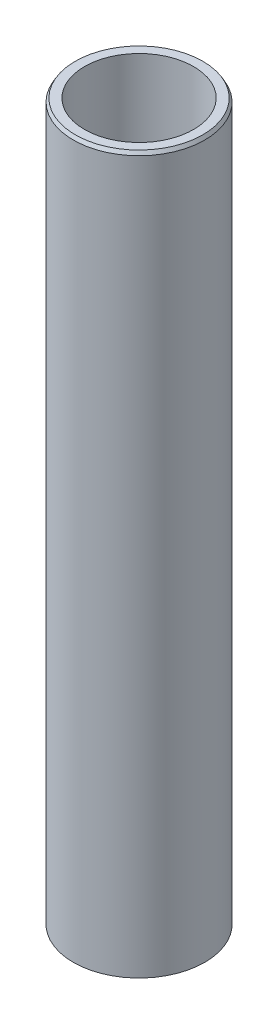
ISO-10303-21;
HEADER;
FILE_DESCRIPTION(('STEP AP214'),'2;1');
FILE_NAME('part.step','',(''),(''),'','','');
FILE_SCHEMA(('AUTOMOTIVE_DESIGN { 1 0 10303 214 1 1 1 1 }'));
ENDSEC;
DATA;
#1=APPLICATION_CONTEXT('core data for automotive mechanical design processes');
#2=APPLICATION_PROTOCOL_DEFINITION('international standard','automotive_design',2000,#1);
#3=PRODUCT_CONTEXT('',#1,'mechanical');
#4=PRODUCT('Part','Part','',(#3));
#5=PRODUCT_RELATED_PRODUCT_CATEGORY('part','',(#4));
#6=PRODUCT_DEFINITION_FORMATION('','',#4);
#7=PRODUCT_DEFINITION_CONTEXT('part definition',#1,'design');
#8=PRODUCT_DEFINITION('design','',#6,#7);
#9=PRODUCT_DEFINITION_SHAPE('','',#8);
#10=(LENGTH_UNIT() NAMED_UNIT(*) SI_UNIT(.MILLI.,.METRE.));
#11=(NAMED_UNIT(*) PLANE_ANGLE_UNIT() SI_UNIT($,.RADIAN.));
#12=(NAMED_UNIT(*) SI_UNIT($,.STERADIAN.) SOLID_ANGLE_UNIT());
#13=UNCERTAINTY_MEASURE_WITH_UNIT(LENGTH_MEASURE(1.E-05),#10,'distance_accuracy_value','');
#14=(GEOMETRIC_REPRESENTATION_CONTEXT(3) GLOBAL_UNCERTAINTY_ASSIGNED_CONTEXT((#13)) GLOBAL_UNIT_ASSIGNED_CONTEXT((#10,
#11,#12)) REPRESENTATION_CONTEXT('',''));
#15=CARTESIAN_POINT('',(0.,0.,0.));
#16=DIRECTION('',(0.,0.,1.));
#17=DIRECTION('',(1.,0.,0.));
#18=AXIS2_PLACEMENT_3D('',#15,#16,#17);
#19=CARTESIAN_POINT('',(0.,600.,0.));
#20=DIRECTION('',(0.,-1.,0.));
#21=DIRECTION('',(0.,0.,-1.));
#22=AXIS2_PLACEMENT_3D('',#19,#20,#21);
#23=CYLINDRICAL_SURFACE('',#22,55.);
#24=CARTESIAN_POINT('',(0.,597.078124167466,0.));
#25=DIRECTION('',(0.,1.,0.));
#26=DIRECTION('',(0.,0.,1.));
#27=AXIS2_PLACEMENT_3D('',#24,#25,#26);
#28=CIRCLE('',#27,55.);
#29=CARTESIAN_POINT('',(0.,597.078124167465,-55.));
#30=VERTEX_POINT('',#29);
#31=EDGE_CURVE('E50',#30,#30,#28,.F.);
#32=ORIENTED_EDGE('',*,*,#31,.T.);
#33=EDGE_LOOP('',(#32));
#34=FACE_BOUND('',#33,.T.);
#35=CARTESIAN_POINT('',(0.,1.6869457984523,0.));
#36=DIRECTION('',(0.,1.,0.));
#37=DIRECTION('',(0.,0.,1.));
#38=AXIS2_PLACEMENT_3D('',#35,#36,#37);
#39=CIRCLE('',#38,55.);
#40=CARTESIAN_POINT('',(0.,1.6869457984523,55.));
#41=VERTEX_POINT('',#40);
#42=EDGE_CURVE('E51',#41,#41,#39,.T.);
#43=ORIENTED_EDGE('',*,*,#42,.T.);
#44=EDGE_LOOP('',(#43));
#45=FACE_BOUND('',#44,.T.);
#46=ADVANCED_FACE('F39',(#34,#45),#23,.T.);
#47=CARTESIAN_POINT('',(0.,600.,0.));
#48=DIRECTION('',(0.,1.,0.));
#49=DIRECTION('',(0.,0.,1.));
#50=AXIS2_PLACEMENT_3D('',#47,#48,#49);
#51=PLANE('',#50);
#52=CARTESIAN_POINT('',(0.,600.,0.));
#53=DIRECTION('',(0.,1.,0.));
#54=DIRECTION('',(0.,0.,1.));
#55=AXIS2_PLACEMENT_3D('',#52,#53,#54);
#56=CIRCLE('',#55,53.3130542015477);
#57=CARTESIAN_POINT('',(0.,600.,-53.3130542015477));
#58=VERTEX_POINT('',#57);
#59=EDGE_CURVE('E54',#58,#58,#56,.T.);
#60=ORIENTED_EDGE('',*,*,#59,.T.);
#61=EDGE_LOOP('',(#60));
#62=FACE_BOUND('',#61,.T.);
#63=CARTESIAN_POINT('',(0.,600.,0.));
#64=DIRECTION('',(0.,1.,0.));
#65=DIRECTION('',(0.,0.,1.));
#66=AXIS2_PLACEMENT_3D('',#63,#64,#65);
#67=CIRCLE('',#66,45.6130111693613);
#68=CARTESIAN_POINT('',(0.,600.,45.6130111693613));
#69=VERTEX_POINT('',#68);
#70=EDGE_CURVE('E58',#69,#69,#67,.T.);
#71=ORIENTED_EDGE('',*,*,#70,.F.);
#72=EDGE_LOOP('',(#71));
#73=FACE_BOUND('',#72,.T.);
#74=ADVANCED_FACE('F69',(#62,#73),#51,.T.);
#75=CARTESIAN_POINT('',(0.,0.,0.));
#76=DIRECTION('',(0.,1.,0.));
#77=DIRECTION('',(0.,0.,1.));
#78=AXIS2_PLACEMENT_3D('',#75,#76,#77);
#79=PLANE('',#78);
#80=CARTESIAN_POINT('',(0.,0.,0.));
#81=DIRECTION('',(0.,1.,0.));
#82=DIRECTION('',(0.,0.,1.));
#83=AXIS2_PLACEMENT_3D('',#80,#81,#82);
#84=CIRCLE('',#83,52.0781241674658);
#85=CARTESIAN_POINT('',(0.,0.,52.0781241674658));
#86=VERTEX_POINT('',#85);
#87=EDGE_CURVE('E10',#86,#86,#84,.F.);
#88=ORIENTED_EDGE('',*,*,#87,.T.);
#89=EDGE_LOOP('',(#88));
#90=FACE_BOUND('',#89,.T.);
#91=CARTESIAN_POINT('',(0.,0.,0.));
#92=DIRECTION('',(0.,1.,0.));
#93=DIRECTION('',(0.,0.,1.));
#94=AXIS2_PLACEMENT_3D('',#91,#92,#93);
#95=CIRCLE('',#94,45.6130111693613);
#96=CARTESIAN_POINT('',(0.,0.,45.6130111693613));
#97=VERTEX_POINT('',#96);
#98=EDGE_CURVE('E63',#97,#97,#95,.T.);
#99=ORIENTED_EDGE('',*,*,#98,.T.);
#100=EDGE_LOOP('',(#99));
#101=FACE_BOUND('',#100,.T.);
#102=ADVANCED_FACE('F75',(#90,#101),#79,.F.);
#103=CARTESIAN_POINT('',(0.,600.,0.));
#104=DIRECTION('',(0.,-1.,0.));
#105=DIRECTION('',(0.,0.,-1.));
#106=AXIS2_PLACEMENT_3D('',#103,#104,#105);
#107=CYLINDRICAL_SURFACE('',#106,45.6130111693613);
#108=ORIENTED_EDGE('',*,*,#70,.T.);
#109=EDGE_LOOP('',(#108));
#110=FACE_BOUND('',#109,.T.);
#111=ORIENTED_EDGE('',*,*,#98,.F.);
#112=EDGE_LOOP('',(#111));
#113=FACE_BOUND('',#112,.T.);
#114=ADVANCED_FACE('F70',(#110,#113),#107,.F.);
#115=CARTESIAN_POINT('',(0.,600.,0.));
#116=DIRECTION('',(0.,-1.,0.));
#117=DIRECTION('',(0.,0.,-1.));
#118=AXIS2_PLACEMENT_3D('',#115,#116,#117);
#119=CONICAL_SURFACE('',#118,53.3130542015477,0.523598775598285);
#120=CARTESIAN_POINT('',(0.,597.078124167465,-55.));
#121=CARTESIAN_POINT('',(0.,597.108560374054,-54.9824276479328));
#122=CARTESIAN_POINT('',(0.,597.138996580643,-54.9648552958656));
#123=CARTESIAN_POINT('',(0.,597.199868993821,-54.9297105917312));
#124=CARTESIAN_POINT('',(0.,597.23030520041,-54.912138239664));
#125=CARTESIAN_POINT('',(0.,597.291177613588,-54.8769935355296));
#126=CARTESIAN_POINT('',(0.,597.321613820177,-54.8594211834623));
#127=CARTESIAN_POINT('',(0.,597.382486233355,-54.8242764793279));
#128=CARTESIAN_POINT('',(0.,597.412922439943,-54.8067041272607));
#129=CARTESIAN_POINT('',(0.,597.473794853121,-54.7715594231263));
#130=CARTESIAN_POINT('',(0.,597.50423105971,-54.7539870710591));
#131=CARTESIAN_POINT('',(0.,597.565103472888,-54.7188423669247));
#132=CARTESIAN_POINT('',(0.,597.595539679477,-54.7012700148574));
#133=CARTESIAN_POINT('',(0.,597.656412092655,-54.666125310723));
#134=CARTESIAN_POINT('',(0.,597.686848299244,-54.6485529586558));
#135=CARTESIAN_POINT('',(0.,597.747720712421,-54.6134082545214));
#136=CARTESIAN_POINT('',(0.,597.77815691901,-54.5958359024542));
#137=CARTESIAN_POINT('',(0.,597.839029332188,-54.5606911983197));
#138=CARTESIAN_POINT('',(0.,597.869465538777,-54.5431188462525));
#139=CARTESIAN_POINT('',(0.,597.930337951955,-54.5079741421181));
#140=CARTESIAN_POINT('',(0.,597.960774158544,-54.4904017900509));
#141=CARTESIAN_POINT('',(0.,598.021646571721,-54.4552570859165));
#142=CARTESIAN_POINT('',(0.,598.05208277831,-54.4376847338493));
#143=CARTESIAN_POINT('',(0.,598.112955191488,-54.4025400297148));
#144=CARTESIAN_POINT('',(0.,598.143391398077,-54.3849676776476));
#145=CARTESIAN_POINT('',(0.,598.204263811255,-54.3498229735132));
#146=CARTESIAN_POINT('',(0.,598.234700017844,-54.332250621446));
#147=CARTESIAN_POINT('',(0.,598.295572431022,-54.2971059173116));
#148=CARTESIAN_POINT('',(0.,598.32600863761,-54.2795335652444));
#149=CARTESIAN_POINT('',(0.,598.386881050788,-54.2443888611099));
#150=CARTESIAN_POINT('',(0.,598.417317257377,-54.2268165090427));
#151=CARTESIAN_POINT('',(0.,598.478189670555,-54.1916718049083));
#152=CARTESIAN_POINT('',(0.,598.508625877144,-54.1740994528411));
#153=CARTESIAN_POINT('',(0.,598.569498290322,-54.1389547487067));
#154=CARTESIAN_POINT('',(0.,598.59993449691,-54.1213823966395));
#155=CARTESIAN_POINT('',(0.,598.660806910088,-54.086237692505));
#156=CARTESIAN_POINT('',(0.,598.691243116677,-54.0686653404378));
#157=CARTESIAN_POINT('',(0.,598.752115529855,-54.0335206363034));
#158=CARTESIAN_POINT('',(0.,598.782551736444,-54.0159482842362));
#159=CARTESIAN_POINT('',(0.,598.843424149622,-53.9808035801018));
#160=CARTESIAN_POINT('',(0.,598.873860356211,-53.9632312280346));
#161=CARTESIAN_POINT('',(0.,598.934732769388,-53.9280865239001));
#162=CARTESIAN_POINT('',(0.,598.965168975977,-53.9105141718329));
#163=CARTESIAN_POINT('',(0.,599.026041389155,-53.8753694676985));
#164=CARTESIAN_POINT('',(0.,599.056477595744,-53.8577971156313));
#165=CARTESIAN_POINT('',(0.,599.117350008922,-53.8226524114969));
#166=CARTESIAN_POINT('',(0.,599.147786215511,-53.8050800594296));
#167=CARTESIAN_POINT('',(0.,599.208658628689,-53.7699353552952));
#168=CARTESIAN_POINT('',(0.,599.239094835277,-53.752363003228));
#169=CARTESIAN_POINT('',(0.,599.299967248455,-53.7172182990936));
#170=CARTESIAN_POINT('',(0.,599.330403455044,-53.6996459470264));
#171=CARTESIAN_POINT('',(0.,599.391275868222,-53.664501242892));
#172=CARTESIAN_POINT('',(0.,599.421712074811,-53.6469288908247));
#173=CARTESIAN_POINT('',(0.,599.482584487989,-53.6117841866903));
#174=CARTESIAN_POINT('',(0.,599.513020694577,-53.5942118346231));
#175=CARTESIAN_POINT('',(0.,599.573893107755,-53.5590671304887));
#176=CARTESIAN_POINT('',(0.,599.604329314344,-53.5414947784215));
#177=CARTESIAN_POINT('',(0.,599.665201727522,-53.5063500742871));
#178=CARTESIAN_POINT('',(0.,599.695637934111,-53.4887777222198));
#179=CARTESIAN_POINT('',(0.,599.756510347289,-53.4536330180854));
#180=CARTESIAN_POINT('',(0.,599.786946553878,-53.4360606660182));
#181=CARTESIAN_POINT('',(0.,599.847818967055,-53.4009159618838));
#182=CARTESIAN_POINT('',(0.,599.878255173644,-53.3833436098166));
#183=CARTESIAN_POINT('',(0.,599.939127586822,-53.3481989056821));
#184=CARTESIAN_POINT('',(0.,599.969563793411,-53.3306265536149));
#185=CARTESIAN_POINT('',(0.,600.,-53.3130542015477));
#186=B_SPLINE_CURVE_WITH_KNOTS('',3,(#120,#121,#122,#123,#124,#125,#126,#127,#128,#129,#130,
#131,#132,#133,#134,#135,#136,#137,#138,#139,#140,#141,#142,#143,#144,#145,#146,#147,#148,#149,
#150,#151,#152,#153,#154,#155,#156,#157,#158,#159,#160,#161,#162,#163,#164,#165,#166,#167,#168,
#169,#170,#171,#172,#173,#174,#175,#176,#177,#178,#179,#180,#181,#182,#183,#184,#185),
.UNSPECIFIED.,.F.,.F.,(4,2,2,2,2,2,2,2,2,2,2,2,2,2,2,2,2,2,2,2,2,2,2,2,2,2,2,2,2,2,2,2,4),(0.,
0.105434112403365,0.210868224806633,0.316302337209902,0.421736449613171,0.527170562016439,
0.632604674419708,0.73803878682298,0.843472899226249,0.948907011629517,1.05434112403279,
1.15977523643605,1.26520934883932,1.37064346124259,1.47607757364586,1.58151168604913,
1.6869457984524,1.79237991085567,1.89781402325894,2.0032481356622,2.10868224806547,
2.21411636046874,2.31955047287201,2.42498458527528,2.53041869767855,2.63585281008182,
2.74128692248509,2.84672103488835,2.95215514729162,3.05758925969489,3.16302337209816,
3.26845748450143,3.37389159690479),.UNSPECIFIED.);
#187=EDGE_CURVE('BSEAM81',#30,#58,#186,.T.);
#188=ORIENTED_EDGE('',*,*,#31,.F.);
#189=ORIENTED_EDGE('',*,*,#59,.F.);
#190=ORIENTED_EDGE('',*,*,#187,.T.);
#191=ORIENTED_EDGE('',*,*,#187,.F.);
#192=EDGE_LOOP('',(#188,#190,#189,#191));
#193=FACE_BOUND('',#192,.T.);
#194=ADVANCED_FACE('F81',(#193),#119,.T.);
#195=CARTESIAN_POINT('',(0.,1.6869457984523,0.));
#196=DIRECTION('',(0.,1.,0.));
#197=DIRECTION('',(0.,0.,1.));
#198=AXIS2_PLACEMENT_3D('',#195,#196,#197);
#199=CONICAL_SURFACE('',#198,55.,1.04719755119659);
#200=ORIENTED_EDGE('',*,*,#87,.F.);
#201=EDGE_LOOP('',(#200));
#202=FACE_BOUND('',#201,.T.);
#203=ORIENTED_EDGE('',*,*,#42,.F.);
#204=EDGE_LOOP('',(#203));
#205=FACE_BOUND('',#204,.T.);
#206=ADVANCED_FACE('F45',(#202,#205),#199,.T.);
#207=CLOSED_SHELL('',(#46,#74,#102,#114,#194,#206));
#208=MANIFOLD_SOLID_BREP('B2',#207);
#209=ADVANCED_BREP_SHAPE_REPRESENTATION('',(#18,#208),#14);
#210=SHAPE_DEFINITION_REPRESENTATION(#9,#209);
ENDSEC;
END-ISO-10303-21;
